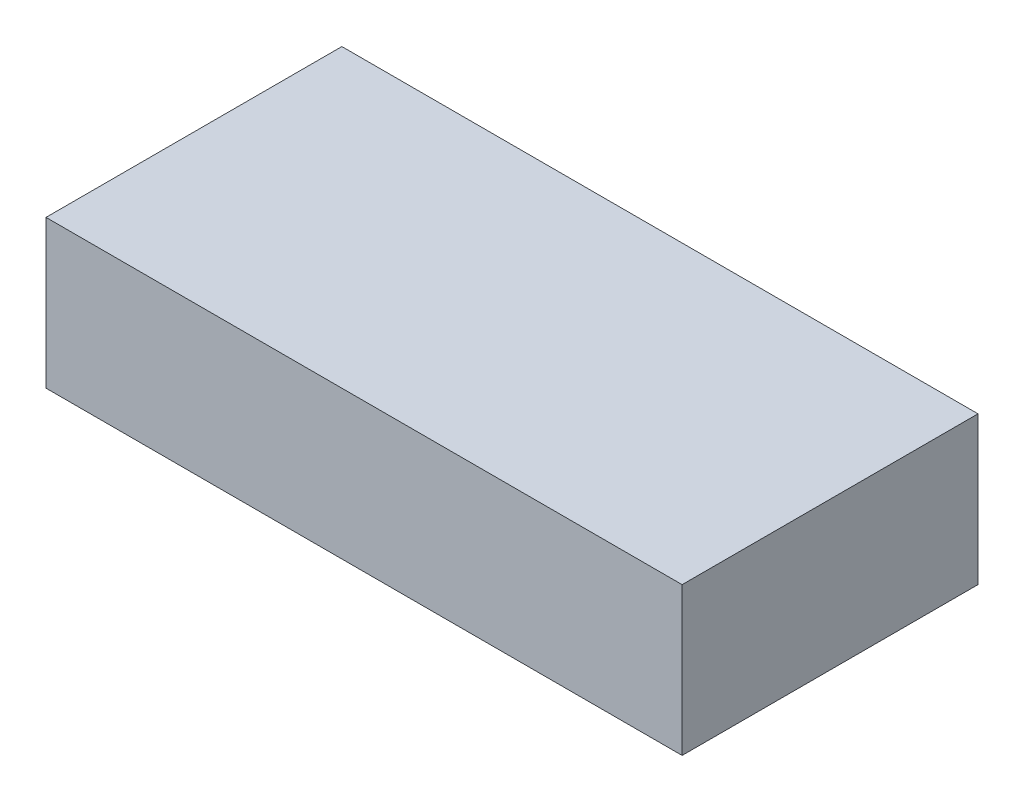
ISO-10303-21;
HEADER;
FILE_DESCRIPTION(('STEP AP214'),'2;1');
FILE_NAME('part.step','',(''),(''),'','','');
FILE_SCHEMA(('AUTOMOTIVE_DESIGN { 1 0 10303 214 1 1 1 1 }'));
ENDSEC;
DATA;
#1=APPLICATION_CONTEXT('core data for automotive mechanical design processes');
#2=APPLICATION_PROTOCOL_DEFINITION('international standard','automotive_design',2000,#1);
#3=PRODUCT_CONTEXT('',#1,'mechanical');
#4=PRODUCT('Part','Part','',(#3));
#5=PRODUCT_RELATED_PRODUCT_CATEGORY('part','',(#4));
#6=PRODUCT_DEFINITION_FORMATION('','',#4);
#7=PRODUCT_DEFINITION_CONTEXT('part definition',#1,'design');
#8=PRODUCT_DEFINITION('design','',#6,#7);
#9=PRODUCT_DEFINITION_SHAPE('','',#8);
#10=(LENGTH_UNIT() NAMED_UNIT(*) SI_UNIT(.MILLI.,.METRE.));
#11=(NAMED_UNIT(*) PLANE_ANGLE_UNIT() SI_UNIT($,.RADIAN.));
#12=(NAMED_UNIT(*) SI_UNIT($,.STERADIAN.) SOLID_ANGLE_UNIT());
#13=UNCERTAINTY_MEASURE_WITH_UNIT(LENGTH_MEASURE(1.E-05),#10,'distance_accuracy_value','');
#14=(GEOMETRIC_REPRESENTATION_CONTEXT(3) GLOBAL_UNCERTAINTY_ASSIGNED_CONTEXT((#13)) GLOBAL_UNIT_ASSIGNED_CONTEXT((#10,
#11,#12)) REPRESENTATION_CONTEXT('',''));
#15=CARTESIAN_POINT('',(0.,0.,0.));
#16=DIRECTION('',(0.,0.,1.));
#17=DIRECTION('',(1.,0.,0.));
#18=AXIS2_PLACEMENT_3D('',#15,#16,#17);
#19=CARTESIAN_POINT('',(-1.07499912,0.25000204,0.));
#20=DIRECTION('',(0.,1.,0.));
#21=DIRECTION('',(0.,0.,1.));
#22=AXIS2_PLACEMENT_3D('',#19,#20,#21);
#23=PLANE('',#22);
#24=DIRECTION('',(0.,0.,-1.));
#25=VECTOR('',#24,1.);
#26=CARTESIAN_POINT('',(1.07500166,0.25000204,0.));
#27=LINE('',#26,#25);
#28=CARTESIAN_POINT('',(1.07500166,0.25000204,0.));
#29=VERTEX_POINT('',#28);
#30=CARTESIAN_POINT('',(1.07500166,0.25000204,1.00000054));
#31=VERTEX_POINT('',#30);
#32=EDGE_CURVE('E20',#29,#31,#27,.F.);
#33=ORIENTED_EDGE('',*,*,#32,.F.);
#34=DIRECTION('',(1.,0.,0.));
#35=VECTOR('',#34,1.);
#36=CARTESIAN_POINT('',(1.07500166,0.25000204,0.));
#37=LINE('',#36,#35);
#38=CARTESIAN_POINT('',(-1.07499912,0.25000204,0.));
#39=VERTEX_POINT('',#38);
#40=EDGE_CURVE('E80',#29,#39,#37,.F.);
#41=ORIENTED_EDGE('',*,*,#40,.T.);
#42=DIRECTION('',(0.,0.,1.));
#43=VECTOR('',#42,1.);
#44=CARTESIAN_POINT('',(-1.07499912,0.25000204,0.));
#45=LINE('',#44,#43);
#46=CARTESIAN_POINT('',(-1.07499912,0.25000204,1.00000054));
#47=VERTEX_POINT('',#46);
#48=EDGE_CURVE('E68',#47,#39,#45,.F.);
#49=ORIENTED_EDGE('',*,*,#48,.F.);
#50=DIRECTION('',(1.,0.,0.));
#51=VECTOR('',#50,1.);
#52=CARTESIAN_POINT('',(1.07500166,0.25000204,1.00000054));
#53=LINE('',#52,#51);
#54=EDGE_CURVE('E56',#31,#47,#53,.F.);
#55=ORIENTED_EDGE('',*,*,#54,.F.);
#56=EDGE_LOOP('',(#33,#41,#49,#55));
#57=FACE_BOUND('',#56,.T.);
#58=ADVANCED_FACE('F17',(#57),#23,.T.);
#59=CARTESIAN_POINT('',(1.07500166,0.25000204,0.));
#60=DIRECTION('',(1.,0.,0.));
#61=DIRECTION('',(0.,0.,-1.));
#62=AXIS2_PLACEMENT_3D('',#59,#60,#61);
#63=PLANE('',#62);
#64=DIRECTION('',(0.,0.,-1.));
#65=VECTOR('',#64,1.);
#66=CARTESIAN_POINT('',(1.07500166,-0.2499995,0.));
#67=LINE('',#66,#65);
#68=CARTESIAN_POINT('',(1.07500166,-0.2499995,0.));
#69=VERTEX_POINT('',#68);
#70=CARTESIAN_POINT('',(1.07500166,-0.2499995,1.00000054));
#71=VERTEX_POINT('',#70);
#72=EDGE_CURVE('E83',#69,#71,#67,.F.);
#73=ORIENTED_EDGE('',*,*,#72,.F.);
#74=DIRECTION('',(0.,1.,0.));
#75=VECTOR('',#74,1.);
#76=CARTESIAN_POINT('',(1.07500166,-0.2499995,0.));
#77=LINE('',#76,#75);
#78=EDGE_CURVE('E65',#69,#29,#77,.T.);
#79=ORIENTED_EDGE('',*,*,#78,.T.);
#80=ORIENTED_EDGE('',*,*,#32,.T.);
#81=DIRECTION('',(0.,1.,0.));
#82=VECTOR('',#81,1.);
#83=CARTESIAN_POINT('',(1.07500166,-0.2499995,1.00000054));
#84=LINE('',#83,#82);
#85=EDGE_CURVE('E62',#71,#31,#84,.T.);
#86=ORIENTED_EDGE('',*,*,#85,.F.);
#87=EDGE_LOOP('',(#73,#79,#80,#86));
#88=FACE_BOUND('',#87,.T.);
#89=ADVANCED_FACE('F61',(#88),#63,.T.);
#90=CARTESIAN_POINT('',(1.07500166,-0.2499995,1.00000054));
#91=DIRECTION('',(0.,0.,1.));
#92=DIRECTION('',(1.,0.,0.));
#93=AXIS2_PLACEMENT_3D('',#90,#91,#92);
#94=PLANE('',#93);
#95=DIRECTION('',(0.,1.,0.));
#96=VECTOR('',#95,1.);
#97=CARTESIAN_POINT('',(-1.07499912,-0.2499995,1.00000054));
#98=LINE('',#97,#96);
#99=CARTESIAN_POINT('',(-1.07499912,-0.2499995,1.00000054));
#100=VERTEX_POINT('',#99);
#101=EDGE_CURVE('E70',#100,#47,#98,.T.);
#102=ORIENTED_EDGE('',*,*,#101,.F.);
#103=DIRECTION('',(1.,0.,0.));
#104=VECTOR('',#103,1.);
#105=CARTESIAN_POINT('',(1.07500166,-0.2499995,1.00000054));
#106=LINE('',#105,#104);
#107=EDGE_CURVE('E74',#71,#100,#106,.F.);
#108=ORIENTED_EDGE('',*,*,#107,.F.);
#109=ORIENTED_EDGE('',*,*,#85,.T.);
#110=ORIENTED_EDGE('',*,*,#54,.T.);
#111=EDGE_LOOP('',(#102,#108,#109,#110));
#112=FACE_BOUND('',#111,.T.);
#113=ADVANCED_FACE('F72',(#112),#94,.T.);
#114=CARTESIAN_POINT('',(-1.07499912,-0.2499995,0.));
#115=DIRECTION('',(-1.,0.,0.));
#116=DIRECTION('',(0.,0.,1.));
#117=AXIS2_PLACEMENT_3D('',#114,#115,#116);
#118=PLANE('',#117);
#119=ORIENTED_EDGE('',*,*,#48,.T.);
#120=DIRECTION('',(0.,1.,0.));
#121=VECTOR('',#120,1.);
#122=CARTESIAN_POINT('',(-1.07499912,-0.2499995,0.));
#123=LINE('',#122,#121);
#124=CARTESIAN_POINT('',(-1.07499912,-0.2499995,0.));
#125=VERTEX_POINT('',#124);
#126=EDGE_CURVE('E35',#39,#125,#123,.F.);
#127=ORIENTED_EDGE('',*,*,#126,.T.);
#128=DIRECTION('',(0.,0.,-1.));
#129=VECTOR('',#128,1.);
#130=CARTESIAN_POINT('',(-1.07499912,-0.2499995,0.));
#131=LINE('',#130,#129);
#132=EDGE_CURVE('E26',#100,#125,#131,.T.);
#133=ORIENTED_EDGE('',*,*,#132,.F.);
#134=ORIENTED_EDGE('',*,*,#101,.T.);
#135=EDGE_LOOP('',(#119,#127,#133,#134));
#136=FACE_BOUND('',#135,.T.);
#137=ADVANCED_FACE('F89',(#136),#118,.T.);
#138=CARTESIAN_POINT('',(1.07500166,-0.2499995,0.));
#139=DIRECTION('',(0.,0.,1.));
#140=DIRECTION('',(1.,0.,0.));
#141=AXIS2_PLACEMENT_3D('',#138,#139,#140);
#142=PLANE('',#141);
#143=ORIENTED_EDGE('',*,*,#126,.F.);
#144=ORIENTED_EDGE('',*,*,#40,.F.);
#145=ORIENTED_EDGE('',*,*,#78,.F.);
#146=DIRECTION('',(1.,0.,0.));
#147=VECTOR('',#146,1.);
#148=CARTESIAN_POINT('',(1.07500166,-0.2499995,0.));
#149=LINE('',#148,#147);
#150=EDGE_CURVE('E11',#125,#69,#149,.T.);
#151=ORIENTED_EDGE('',*,*,#150,.F.);
#152=EDGE_LOOP('',(#143,#144,#145,#151));
#153=FACE_BOUND('',#152,.T.);
#154=ADVANCED_FACE('F91',(#153),#142,.F.);
#155=CARTESIAN_POINT('',(1.07500166,-0.2499995,0.));
#156=DIRECTION('',(0.,-1.,0.));
#157=DIRECTION('',(0.,0.,-1.));
#158=AXIS2_PLACEMENT_3D('',#155,#156,#157);
#159=PLANE('',#158);
#160=ORIENTED_EDGE('',*,*,#132,.T.);
#161=ORIENTED_EDGE('',*,*,#150,.T.);
#162=ORIENTED_EDGE('',*,*,#72,.T.);
#163=ORIENTED_EDGE('',*,*,#107,.T.);
#164=EDGE_LOOP('',(#160,#161,#162,#163));
#165=FACE_BOUND('',#164,.T.);
#166=ADVANCED_FACE('F88',(#165),#159,.T.);
#167=CLOSED_SHELL('',(#58,#89,#113,#137,#154,#166));
#168=MANIFOLD_SOLID_BREP('B1',#167);
#169=ADVANCED_BREP_SHAPE_REPRESENTATION('',(#18,#168),#14);
#170=SHAPE_DEFINITION_REPRESENTATION(#9,#169);
ENDSEC;
END-ISO-10303-21;
